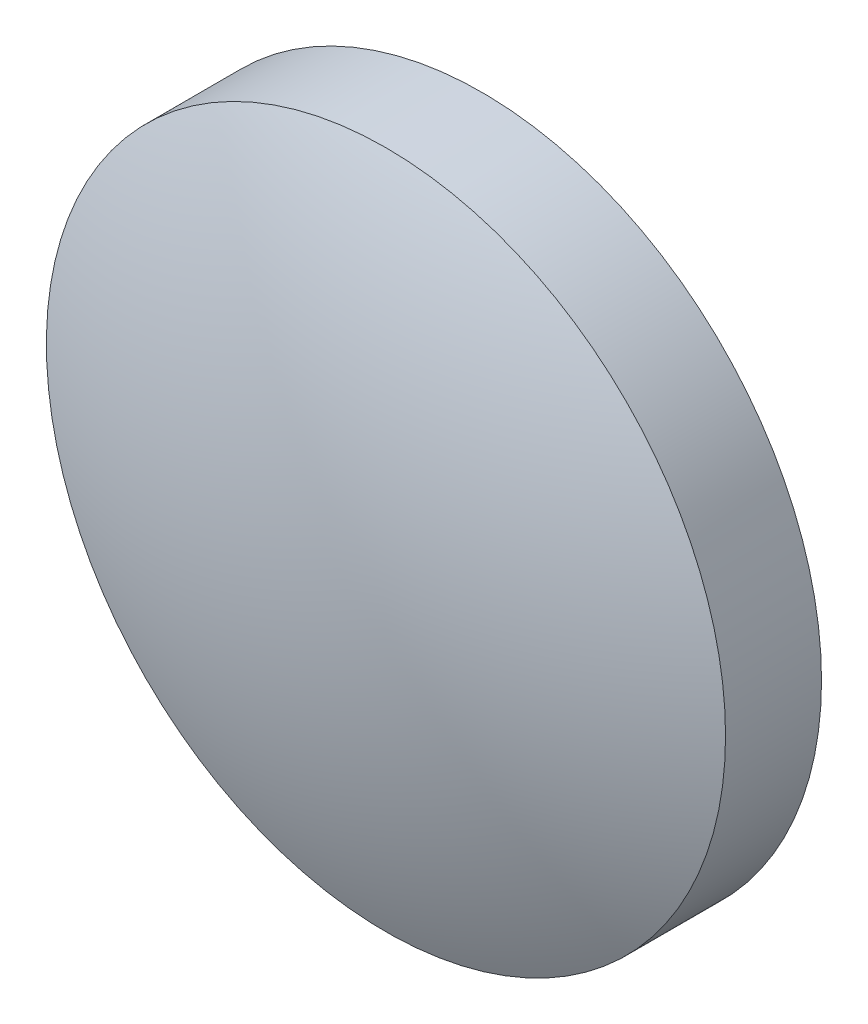
ISO-10303-21;
HEADER;
FILE_DESCRIPTION(('STEP AP214'),'2;1');
FILE_NAME('part.step','',(''),(''),'','','');
FILE_SCHEMA(('AUTOMOTIVE_DESIGN { 1 0 10303 214 1 1 1 1 }'));
ENDSEC;
DATA;
#1=APPLICATION_CONTEXT('core data for automotive mechanical design processes');
#2=APPLICATION_PROTOCOL_DEFINITION('international standard','automotive_design',2000,#1);
#3=PRODUCT_CONTEXT('',#1,'mechanical');
#4=PRODUCT('Part','Part','',(#3));
#5=PRODUCT_RELATED_PRODUCT_CATEGORY('part','',(#4));
#6=PRODUCT_DEFINITION_FORMATION('','',#4);
#7=PRODUCT_DEFINITION_CONTEXT('part definition',#1,'design');
#8=PRODUCT_DEFINITION('design','',#6,#7);
#9=PRODUCT_DEFINITION_SHAPE('','',#8);
#10=(LENGTH_UNIT() NAMED_UNIT(*) SI_UNIT(.MILLI.,.METRE.));
#11=(NAMED_UNIT(*) PLANE_ANGLE_UNIT() SI_UNIT($,.RADIAN.));
#12=(NAMED_UNIT(*) SI_UNIT($,.STERADIAN.) SOLID_ANGLE_UNIT());
#13=UNCERTAINTY_MEASURE_WITH_UNIT(LENGTH_MEASURE(1.E-05),#10,'distance_accuracy_value','');
#14=(GEOMETRIC_REPRESENTATION_CONTEXT(3) GLOBAL_UNCERTAINTY_ASSIGNED_CONTEXT((#13)) GLOBAL_UNIT_ASSIGNED_CONTEXT((#10,
#11,#12)) REPRESENTATION_CONTEXT('',''));
#15=CARTESIAN_POINT('',(0.,0.,0.));
#16=DIRECTION('',(0.,0.,1.));
#17=DIRECTION('',(1.,0.,0.));
#18=AXIS2_PLACEMENT_3D('',#15,#16,#17);
#19=CARTESIAN_POINT('',(0.,0.,-13.87));
#20=DIRECTION('',(0.,0.,1.));
#21=DIRECTION('',(0.,1.,0.));
#22=AXIS2_PLACEMENT_3D('',#19,#20,#21);
#23=SPHERICAL_SURFACE('',#22,15.45);
#24=CARTESIAN_POINT('',(0.,0.,0.214743519141553));
#25=DIRECTION('',(0.,0.,1.));
#26=DIRECTION('',(1.,0.,0.));
#27=AXIS2_PLACEMENT_3D('',#24,#25,#26);
#28=CIRCLE('',#27,6.35);
#29=CARTESIAN_POINT('',(6.35,0.,0.214743519141553));
#30=VERTEX_POINT('',#29);
#31=EDGE_CURVE('E8',#30,#30,#28,.T.);
#32=ORIENTED_EDGE('',*,*,#31,.T.);
#33=EDGE_LOOP('',(#32));
#34=FACE_BOUND('',#33,.T.);
#35=ADVANCED_FACE('F12',(#34),#23,.T.);
#36=CARTESIAN_POINT('',(0.,0.,4.30813204540037));
#37=DIRECTION('',(0.,0.,1.));
#38=DIRECTION('',(1.,0.,0.));
#39=AXIS2_PLACEMENT_3D('',#36,#37,#38);
#40=CYLINDRICAL_SURFACE('',#39,6.35);
#41=ORIENTED_EDGE('',*,*,#31,.F.);
#42=EDGE_LOOP('',(#41));
#43=FACE_BOUND('',#42,.T.);
#44=CARTESIAN_POINT('',(0.,0.,-1.58));
#45=DIRECTION('',(0.,0.,1.));
#46=DIRECTION('',(1.,0.,0.));
#47=AXIS2_PLACEMENT_3D('',#44,#45,#46);
#48=CIRCLE('',#47,6.35);
#49=CARTESIAN_POINT('',(6.35,0.,-1.58));
#50=VERTEX_POINT('',#49);
#51=EDGE_CURVE('E18',#50,#50,#48,.T.);
#52=ORIENTED_EDGE('',*,*,#51,.T.);
#53=EDGE_LOOP('',(#52));
#54=FACE_BOUND('',#53,.T.);
#55=ADVANCED_FACE('F24',(#43,#54),#40,.T.);
#56=CARTESIAN_POINT('',(0.,0.,-1.58));
#57=DIRECTION('',(0.,0.,1.));
#58=DIRECTION('',(1.,0.,0.));
#59=AXIS2_PLACEMENT_3D('',#56,#57,#58);
#60=PLANE('',#59);
#61=ORIENTED_EDGE('',*,*,#51,.F.);
#62=EDGE_LOOP('',(#61));
#63=FACE_BOUND('',#62,.T.);
#64=ADVANCED_FACE('F26',(#63),#60,.F.);
#65=CLOSED_SHELL('',(#35,#55,#64));
#66=MANIFOLD_SOLID_BREP('B1',#65);
#67=ADVANCED_BREP_SHAPE_REPRESENTATION('',(#18,#66),#14);
#68=SHAPE_DEFINITION_REPRESENTATION(#9,#67);
ENDSEC;
END-ISO-10303-21;
